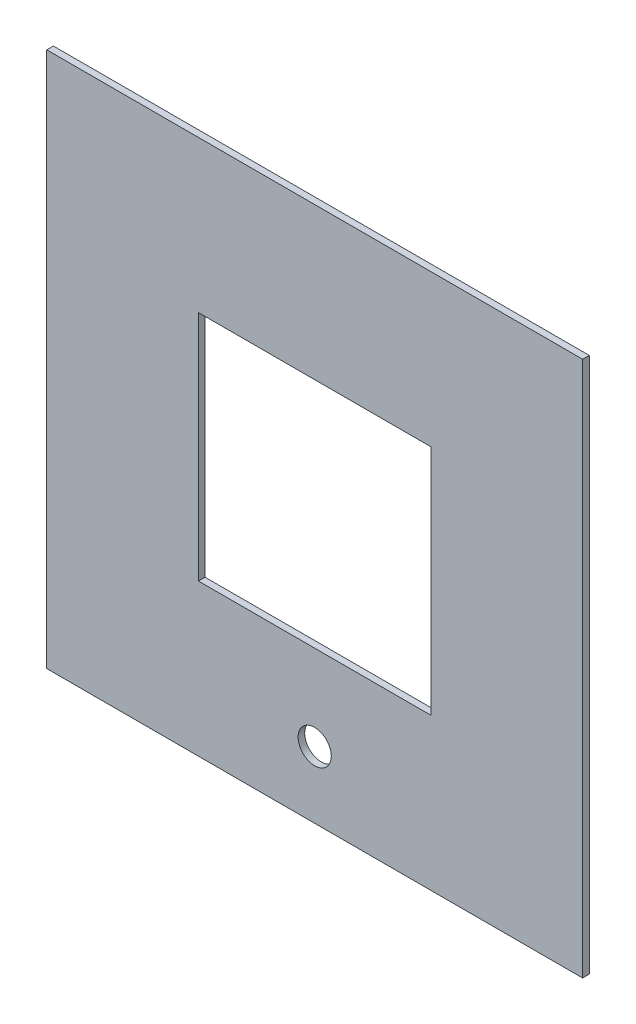
ISO-10303-21;
HEADER;
FILE_DESCRIPTION(('STEP AP214'),'2;1');
FILE_NAME('part.step','',(''),(''),'','','');
FILE_SCHEMA(('AUTOMOTIVE_DESIGN { 1 0 10303 214 1 1 1 1 }'));
ENDSEC;
DATA;
#1=APPLICATION_CONTEXT('core data for automotive mechanical design processes');
#2=APPLICATION_PROTOCOL_DEFINITION('international standard','automotive_design',2000,#1);
#3=PRODUCT_CONTEXT('',#1,'mechanical');
#4=PRODUCT('Part','Part','',(#3));
#5=PRODUCT_RELATED_PRODUCT_CATEGORY('part','',(#4));
#6=PRODUCT_DEFINITION_FORMATION('','',#4);
#7=PRODUCT_DEFINITION_CONTEXT('part definition',#1,'design');
#8=PRODUCT_DEFINITION('design','',#6,#7);
#9=PRODUCT_DEFINITION_SHAPE('','',#8);
#10=(LENGTH_UNIT() NAMED_UNIT(*) SI_UNIT(.MILLI.,.METRE.));
#11=(NAMED_UNIT(*) PLANE_ANGLE_UNIT() SI_UNIT($,.RADIAN.));
#12=(NAMED_UNIT(*) SI_UNIT($,.STERADIAN.) SOLID_ANGLE_UNIT());
#13=UNCERTAINTY_MEASURE_WITH_UNIT(LENGTH_MEASURE(1.E-05),#10,'distance_accuracy_value','');
#14=(GEOMETRIC_REPRESENTATION_CONTEXT(3) GLOBAL_UNCERTAINTY_ASSIGNED_CONTEXT((#13)) GLOBAL_UNIT_ASSIGNED_CONTEXT((#10,
#11,#12)) REPRESENTATION_CONTEXT('',''));
#15=CARTESIAN_POINT('',(0.,0.,0.));
#16=DIRECTION('',(0.,0.,1.));
#17=DIRECTION('',(1.,0.,0.));
#18=AXIS2_PLACEMENT_3D('',#15,#16,#17);
#19=CARTESIAN_POINT('',(0.,0.,3.));
#20=DIRECTION('',(0.,0.,1.));
#21=DIRECTION('',(1.,0.,0.));
#22=AXIS2_PLACEMENT_3D('',#19,#20,#21);
#23=PLANE('',#22);
#24=CARTESIAN_POINT('',(0.,-91.,3.));
#25=DIRECTION('',(0.,0.,1.));
#26=DIRECTION('',(1.,0.,0.));
#27=AXIS2_PLACEMENT_3D('',#24,#25,#26);
#28=CIRCLE('',#27,7.5);
#29=CARTESIAN_POINT('',(7.50000000000004,-91.,3.));
#30=VERTEX_POINT('',#29);
#31=EDGE_CURVE('E230',#30,#30,#28,.T.);
#32=ORIENTED_EDGE('',*,*,#31,.F.);
#33=EDGE_LOOP('',(#32));
#34=FACE_BOUND('',#33,.T.);
#35=DIRECTION('',(0.,1.,0.));
#36=VECTOR('',#35,1.);
#37=CARTESIAN_POINT('',(121.,121.,3.));
#38=LINE('',#37,#36);
#39=CARTESIAN_POINT('',(121.,-121.,3.));
#40=VERTEX_POINT('',#39);
#41=CARTESIAN_POINT('',(121.,121.,3.));
#42=VERTEX_POINT('',#41);
#43=EDGE_CURVE('E144',#40,#42,#38,.T.);
#44=ORIENTED_EDGE('',*,*,#43,.T.);
#45=DIRECTION('',(-1.,0.,0.));
#46=VECTOR('',#45,1.);
#47=CARTESIAN_POINT('',(-121.,121.,3.));
#48=LINE('',#47,#46);
#49=CARTESIAN_POINT('',(-121.,121.,3.));
#50=VERTEX_POINT('',#49);
#51=EDGE_CURVE('E147',#42,#50,#48,.T.);
#52=ORIENTED_EDGE('',*,*,#51,.T.);
#53=DIRECTION('',(0.,-1.,0.));
#54=VECTOR('',#53,1.);
#55=CARTESIAN_POINT('',(-121.,121.,3.));
#56=LINE('',#55,#54);
#57=CARTESIAN_POINT('',(-121.,-121.,3.));
#58=VERTEX_POINT('',#57);
#59=EDGE_CURVE('E150',#50,#58,#56,.T.);
#60=ORIENTED_EDGE('',*,*,#59,.T.);
#61=DIRECTION('',(1.,0.,0.));
#62=VECTOR('',#61,1.);
#63=CARTESIAN_POINT('',(-121.,-121.,3.));
#64=LINE('',#63,#62);
#65=EDGE_CURVE('E152',#58,#40,#64,.T.);
#66=ORIENTED_EDGE('',*,*,#65,.T.);
#67=EDGE_LOOP('',(#44,#52,#60,#66));
#68=FACE_BOUND('',#67,.T.);
#69=DIRECTION('',(-1.,0.,0.));
#70=VECTOR('',#69,1.);
#71=CARTESIAN_POINT('',(-52.5,52.5,3.));
#72=LINE('',#71,#70);
#73=CARTESIAN_POINT('',(52.5,52.5,3.));
#74=VERTEX_POINT('',#73);
#75=CARTESIAN_POINT('',(-52.5,52.5,3.));
#76=VERTEX_POINT('',#75);
#77=EDGE_CURVE('E114',#74,#76,#72,.T.);
#78=ORIENTED_EDGE('',*,*,#77,.F.);
#79=DIRECTION('',(0.,1.,0.));
#80=VECTOR('',#79,1.);
#81=CARTESIAN_POINT('',(52.5,52.5,3.));
#82=LINE('',#81,#80);
#83=CARTESIAN_POINT('',(52.5,-52.5,3.));
#84=VERTEX_POINT('',#83);
#85=EDGE_CURVE('E106',#84,#74,#82,.T.);
#86=ORIENTED_EDGE('',*,*,#85,.F.);
#87=DIRECTION('',(1.,0.,0.));
#88=VECTOR('',#87,1.);
#89=CARTESIAN_POINT('',(-52.5,-52.5,3.));
#90=LINE('',#89,#88);
#91=CARTESIAN_POINT('',(-52.5,-52.5,3.));
#92=VERTEX_POINT('',#91);
#93=EDGE_CURVE('E128',#92,#84,#90,.T.);
#94=ORIENTED_EDGE('',*,*,#93,.F.);
#95=DIRECTION('',(0.,-1.,0.));
#96=VECTOR('',#95,1.);
#97=CARTESIAN_POINT('',(-52.5,52.5,3.));
#98=LINE('',#97,#96);
#99=EDGE_CURVE('E126',#76,#92,#98,.T.);
#100=ORIENTED_EDGE('',*,*,#99,.F.);
#101=EDGE_LOOP('',(#78,#86,#94,#100));
#102=FACE_BOUND('',#101,.T.);
#103=ADVANCED_FACE('F41',(#34,#68,#102),#23,.T.);
#104=CARTESIAN_POINT('',(0.,0.,0.));
#105=DIRECTION('',(0.,0.,1.));
#106=DIRECTION('',(1.,0.,0.));
#107=AXIS2_PLACEMENT_3D('',#104,#105,#106);
#108=PLANE('',#107);
#109=CARTESIAN_POINT('',(0.,-91.,0.));
#110=DIRECTION('',(0.,0.,1.));
#111=DIRECTION('',(1.,0.,0.));
#112=AXIS2_PLACEMENT_3D('',#109,#110,#111);
#113=CIRCLE('',#112,7.5);
#114=CARTESIAN_POINT('',(7.50000000000004,-91.,0.));
#115=VERTEX_POINT('',#114);
#116=EDGE_CURVE('E134',#115,#115,#113,.F.);
#117=ORIENTED_EDGE('',*,*,#116,.F.);
#118=EDGE_LOOP('',(#117));
#119=FACE_BOUND('',#118,.T.);
#120=DIRECTION('',(0.,1.,0.));
#121=VECTOR('',#120,1.);
#122=CARTESIAN_POINT('',(121.,121.,0.));
#123=LINE('',#122,#121);
#124=CARTESIAN_POINT('',(121.,-121.,0.));
#125=VERTEX_POINT('',#124);
#126=CARTESIAN_POINT('',(121.,121.,0.));
#127=VERTEX_POINT('',#126);
#128=EDGE_CURVE('E122',#125,#127,#123,.T.);
#129=ORIENTED_EDGE('',*,*,#128,.F.);
#130=DIRECTION('',(1.,0.,0.));
#131=VECTOR('',#130,1.);
#132=CARTESIAN_POINT('',(-121.,-121.,0.));
#133=LINE('',#132,#131);
#134=CARTESIAN_POINT('',(-121.,-121.,0.));
#135=VERTEX_POINT('',#134);
#136=EDGE_CURVE('E148',#135,#125,#133,.T.);
#137=ORIENTED_EDGE('',*,*,#136,.F.);
#138=DIRECTION('',(0.,-1.,0.));
#139=VECTOR('',#138,1.);
#140=CARTESIAN_POINT('',(-121.,121.,0.));
#141=LINE('',#140,#139);
#142=CARTESIAN_POINT('',(-121.,121.,0.));
#143=VERTEX_POINT('',#142);
#144=EDGE_CURVE('E159',#143,#135,#141,.T.);
#145=ORIENTED_EDGE('',*,*,#144,.F.);
#146=DIRECTION('',(-1.,0.,0.));
#147=VECTOR('',#146,1.);
#148=CARTESIAN_POINT('',(-121.,121.,0.));
#149=LINE('',#148,#147);
#150=EDGE_CURVE('E157',#127,#143,#149,.T.);
#151=ORIENTED_EDGE('',*,*,#150,.F.);
#152=EDGE_LOOP('',(#129,#137,#145,#151));
#153=FACE_BOUND('',#152,.T.);
#154=DIRECTION('',(0.,1.,0.));
#155=VECTOR('',#154,1.);
#156=CARTESIAN_POINT('',(52.5,52.5,0.));
#157=LINE('',#156,#155);
#158=CARTESIAN_POINT('',(52.5,-52.5,0.));
#159=VERTEX_POINT('',#158);
#160=CARTESIAN_POINT('',(52.5,52.5,0.));
#161=VERTEX_POINT('',#160);
#162=EDGE_CURVE('E64',#159,#161,#157,.T.);
#163=ORIENTED_EDGE('',*,*,#162,.T.);
#164=DIRECTION('',(-1.,0.,0.));
#165=VECTOR('',#164,1.);
#166=CARTESIAN_POINT('',(-52.5,52.5,0.));
#167=LINE('',#166,#165);
#168=CARTESIAN_POINT('',(-52.5,52.5,0.));
#169=VERTEX_POINT('',#168);
#170=EDGE_CURVE('E121',#161,#169,#167,.T.);
#171=ORIENTED_EDGE('',*,*,#170,.T.);
#172=DIRECTION('',(0.,-1.,0.));
#173=VECTOR('',#172,1.);
#174=CARTESIAN_POINT('',(-52.5,52.5,0.));
#175=LINE('',#174,#173);
#176=CARTESIAN_POINT('',(-52.5,-52.5,0.));
#177=VERTEX_POINT('',#176);
#178=EDGE_CURVE('E136',#169,#177,#175,.T.);
#179=ORIENTED_EDGE('',*,*,#178,.T.);
#180=DIRECTION('',(1.,0.,0.));
#181=VECTOR('',#180,1.);
#182=CARTESIAN_POINT('',(-52.5,-52.5,0.));
#183=LINE('',#182,#181);
#184=EDGE_CURVE('E115',#177,#159,#183,.T.);
#185=ORIENTED_EDGE('',*,*,#184,.T.);
#186=EDGE_LOOP('',(#163,#171,#179,#185));
#187=FACE_BOUND('',#186,.T.);
#188=ADVANCED_FACE('F177',(#119,#153,#187),#108,.F.);
#189=CARTESIAN_POINT('',(121.,121.,3.));
#190=DIRECTION('',(-1.,0.,0.));
#191=DIRECTION('',(0.,-1.,0.));
#192=AXIS2_PLACEMENT_3D('',#189,#190,#191);
#193=PLANE('',#192);
#194=ORIENTED_EDGE('',*,*,#128,.T.);
#195=DIRECTION('',(0.,0.,-1.));
#196=VECTOR('',#195,1.);
#197=CARTESIAN_POINT('',(121.,121.,3.));
#198=LINE('',#197,#196);
#199=EDGE_CURVE('E11',#42,#127,#198,.T.);
#200=ORIENTED_EDGE('',*,*,#199,.F.);
#201=ORIENTED_EDGE('',*,*,#43,.F.);
#202=DIRECTION('',(0.,0.,-1.));
#203=VECTOR('',#202,1.);
#204=CARTESIAN_POINT('',(121.,-121.,3.));
#205=LINE('',#204,#203);
#206=EDGE_CURVE('E154',#40,#125,#205,.T.);
#207=ORIENTED_EDGE('',*,*,#206,.T.);
#208=EDGE_LOOP('',(#194,#200,#201,#207));
#209=FACE_BOUND('',#208,.T.);
#210=ADVANCED_FACE('F43',(#209),#193,.F.);
#211=CARTESIAN_POINT('',(-121.,121.,3.));
#212=DIRECTION('',(0.,-1.,0.));
#213=DIRECTION('',(1.,0.,0.));
#214=AXIS2_PLACEMENT_3D('',#211,#212,#213);
#215=PLANE('',#214);
#216=ORIENTED_EDGE('',*,*,#150,.T.);
#217=DIRECTION('',(0.,0.,-1.));
#218=VECTOR('',#217,1.);
#219=CARTESIAN_POINT('',(-121.,121.,3.));
#220=LINE('',#219,#218);
#221=EDGE_CURVE('E49',#50,#143,#220,.T.);
#222=ORIENTED_EDGE('',*,*,#221,.F.);
#223=ORIENTED_EDGE('',*,*,#51,.F.);
#224=ORIENTED_EDGE('',*,*,#199,.T.);
#225=EDGE_LOOP('',(#216,#222,#223,#224));
#226=FACE_BOUND('',#225,.T.);
#227=ADVANCED_FACE('F187',(#226),#215,.F.);
#228=CARTESIAN_POINT('',(-121.,121.,3.));
#229=DIRECTION('',(1.,0.,0.));
#230=DIRECTION('',(0.,1.,0.));
#231=AXIS2_PLACEMENT_3D('',#228,#229,#230);
#232=PLANE('',#231);
#233=ORIENTED_EDGE('',*,*,#144,.T.);
#234=DIRECTION('',(0.,0.,-1.));
#235=VECTOR('',#234,1.);
#236=CARTESIAN_POINT('',(-121.,-121.,3.));
#237=LINE('',#236,#235);
#238=EDGE_CURVE('E164',#58,#135,#237,.T.);
#239=ORIENTED_EDGE('',*,*,#238,.F.);
#240=ORIENTED_EDGE('',*,*,#59,.F.);
#241=ORIENTED_EDGE('',*,*,#221,.T.);
#242=EDGE_LOOP('',(#233,#239,#240,#241));
#243=FACE_BOUND('',#242,.T.);
#244=ADVANCED_FACE('F171',(#243),#232,.F.);
#245=CARTESIAN_POINT('',(-121.,-121.,3.));
#246=DIRECTION('',(0.,1.,0.));
#247=DIRECTION('',(0.,0.,1.));
#248=AXIS2_PLACEMENT_3D('',#245,#246,#247);
#249=PLANE('',#248);
#250=ORIENTED_EDGE('',*,*,#136,.T.);
#251=ORIENTED_EDGE('',*,*,#206,.F.);
#252=ORIENTED_EDGE('',*,*,#65,.F.);
#253=ORIENTED_EDGE('',*,*,#238,.T.);
#254=EDGE_LOOP('',(#250,#251,#252,#253));
#255=FACE_BOUND('',#254,.T.);
#256=ADVANCED_FACE('F181',(#255),#249,.F.);
#257=CARTESIAN_POINT('',(52.5,52.5,3.));
#258=DIRECTION('',(-1.,0.,0.));
#259=DIRECTION('',(0.,0.,1.));
#260=AXIS2_PLACEMENT_3D('',#257,#258,#259);
#261=PLANE('',#260);
#262=ORIENTED_EDGE('',*,*,#162,.F.);
#263=DIRECTION('',(0.,0.,-1.));
#264=VECTOR('',#263,1.);
#265=CARTESIAN_POINT('',(52.5,-52.5,3.));
#266=LINE('',#265,#264);
#267=EDGE_CURVE('E110',#84,#159,#266,.T.);
#268=ORIENTED_EDGE('',*,*,#267,.F.);
#269=ORIENTED_EDGE('',*,*,#85,.T.);
#270=DIRECTION('',(0.,0.,-1.));
#271=VECTOR('',#270,1.);
#272=CARTESIAN_POINT('',(52.5,52.5,3.));
#273=LINE('',#272,#271);
#274=EDGE_CURVE('E109',#74,#161,#273,.T.);
#275=ORIENTED_EDGE('',*,*,#274,.T.);
#276=EDGE_LOOP('',(#262,#268,#269,#275));
#277=FACE_BOUND('',#276,.T.);
#278=ADVANCED_FACE('F108',(#277),#261,.T.);
#279=CARTESIAN_POINT('',(-52.5,52.5,3.));
#280=DIRECTION('',(0.,-1.,0.));
#281=DIRECTION('',(0.,0.,-1.));
#282=AXIS2_PLACEMENT_3D('',#279,#280,#281);
#283=PLANE('',#282);
#284=ORIENTED_EDGE('',*,*,#170,.F.);
#285=ORIENTED_EDGE('',*,*,#274,.F.);
#286=ORIENTED_EDGE('',*,*,#77,.T.);
#287=DIRECTION('',(0.,0.,-1.));
#288=VECTOR('',#287,1.);
#289=CARTESIAN_POINT('',(-52.5,52.5,3.));
#290=LINE('',#289,#288);
#291=EDGE_CURVE('E123',#76,#169,#290,.T.);
#292=ORIENTED_EDGE('',*,*,#291,.T.);
#293=EDGE_LOOP('',(#284,#285,#286,#292));
#294=FACE_BOUND('',#293,.T.);
#295=ADVANCED_FACE('F118',(#294),#283,.T.);
#296=CARTESIAN_POINT('',(-52.5,52.5,3.));
#297=DIRECTION('',(1.,0.,0.));
#298=DIRECTION('',(0.,0.,-1.));
#299=AXIS2_PLACEMENT_3D('',#296,#297,#298);
#300=PLANE('',#299);
#301=ORIENTED_EDGE('',*,*,#178,.F.);
#302=ORIENTED_EDGE('',*,*,#291,.F.);
#303=ORIENTED_EDGE('',*,*,#99,.T.);
#304=DIRECTION('',(0.,0.,-1.));
#305=VECTOR('',#304,1.);
#306=CARTESIAN_POINT('',(-52.5,-52.5,3.));
#307=LINE('',#306,#305);
#308=EDGE_CURVE('E56',#92,#177,#307,.T.);
#309=ORIENTED_EDGE('',*,*,#308,.T.);
#310=EDGE_LOOP('',(#301,#302,#303,#309));
#311=FACE_BOUND('',#310,.T.);
#312=ADVANCED_FACE('F213',(#311),#300,.T.);
#313=CARTESIAN_POINT('',(-52.5,-52.5,3.));
#314=DIRECTION('',(0.,1.,0.));
#315=DIRECTION('',(0.,0.,1.));
#316=AXIS2_PLACEMENT_3D('',#313,#314,#315);
#317=PLANE('',#316);
#318=ORIENTED_EDGE('',*,*,#184,.F.);
#319=ORIENTED_EDGE('',*,*,#308,.F.);
#320=ORIENTED_EDGE('',*,*,#93,.T.);
#321=ORIENTED_EDGE('',*,*,#267,.T.);
#322=EDGE_LOOP('',(#318,#319,#320,#321));
#323=FACE_BOUND('',#322,.T.);
#324=ADVANCED_FACE('F217',(#323),#317,.T.);
#325=CARTESIAN_POINT('',(0.,-91.,-0.00100000000000013));
#326=DIRECTION('',(0.,0.,1.));
#327=DIRECTION('',(1.,0.,0.));
#328=AXIS2_PLACEMENT_3D('',#325,#326,#327);
#329=CYLINDRICAL_SURFACE('',#328,7.5);
#330=ORIENTED_EDGE('',*,*,#31,.T.);
#331=EDGE_LOOP('',(#330));
#332=FACE_BOUND('',#331,.T.);
#333=ORIENTED_EDGE('',*,*,#116,.T.);
#334=EDGE_LOOP('',(#333));
#335=FACE_BOUND('',#334,.T.);
#336=ADVANCED_FACE('F223',(#332,#335),#329,.F.);
#337=CLOSED_SHELL('',(#103,#188,#210,#227,#244,#256,#278,#295,#312,#324,#336));
#338=MANIFOLD_SOLID_BREP('B2',#337);
#339=ADVANCED_BREP_SHAPE_REPRESENTATION('',(#18,#338),#14);
#340=SHAPE_DEFINITION_REPRESENTATION(#9,#339);
ENDSEC;
END-ISO-10303-21;
